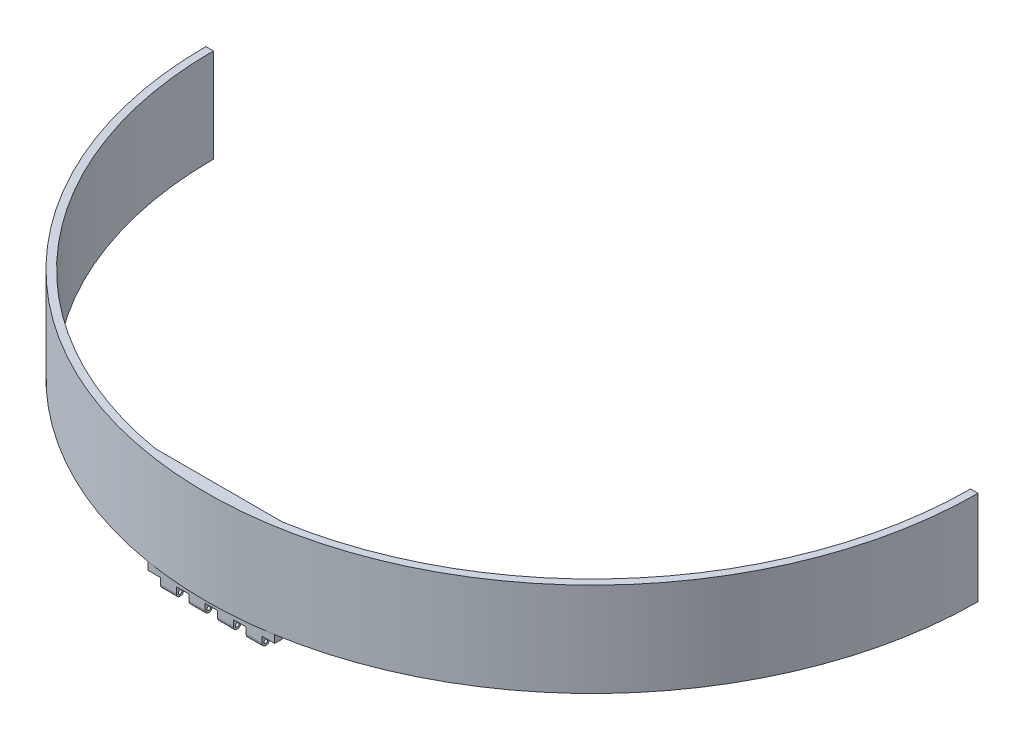
ISO-10303-21;
HEADER;
FILE_DESCRIPTION(('STEP AP214'),'2;1');
FILE_NAME('part.step','',(''),(''),'','','');
FILE_SCHEMA(('AUTOMOTIVE_DESIGN { 1 0 10303 214 1 1 1 1 }'));
ENDSEC;
DATA;
#1=APPLICATION_CONTEXT('core data for automotive mechanical design processes');
#2=APPLICATION_PROTOCOL_DEFINITION('international standard','automotive_design',2000,#1);
#3=PRODUCT_CONTEXT('',#1,'mechanical');
#4=PRODUCT('Part','Part','',(#3));
#5=PRODUCT_RELATED_PRODUCT_CATEGORY('part','',(#4));
#6=PRODUCT_DEFINITION_FORMATION('','',#4);
#7=PRODUCT_DEFINITION_CONTEXT('part definition',#1,'design');
#8=PRODUCT_DEFINITION('design','',#6,#7);
#9=PRODUCT_DEFINITION_SHAPE('','',#8);
#10=(LENGTH_UNIT() NAMED_UNIT(*) SI_UNIT(.MILLI.,.METRE.));
#11=(NAMED_UNIT(*) PLANE_ANGLE_UNIT() SI_UNIT($,.RADIAN.));
#12=(NAMED_UNIT(*) SI_UNIT($,.STERADIAN.) SOLID_ANGLE_UNIT());
#13=UNCERTAINTY_MEASURE_WITH_UNIT(LENGTH_MEASURE(1.E-05),#10,'distance_accuracy_value','');
#14=(GEOMETRIC_REPRESENTATION_CONTEXT(3) GLOBAL_UNCERTAINTY_ASSIGNED_CONTEXT((#13)) GLOBAL_UNIT_ASSIGNED_CONTEXT((#10,
#11,#12)) REPRESENTATION_CONTEXT('',''));
#15=CARTESIAN_POINT('',(0.,0.,0.));
#16=DIRECTION('',(0.,0.,1.));
#17=DIRECTION('',(1.,0.,0.));
#18=AXIS2_PLACEMENT_3D('',#15,#16,#17);
#19=CARTESIAN_POINT('',(-25.,40.,-1.5));
#20=DIRECTION('',(1.,0.,0.));
#21=DIRECTION('',(0.,0.,-1.));
#22=AXIS2_PLACEMENT_3D('',#19,#20,#21);
#23=PLANE('',#22);
#24=DIRECTION('',(0.,0.,1.));
#25=VECTOR('',#24,1.);
#26=CARTESIAN_POINT('',(-25.,3.,-1.5));
#27=LINE('',#26,#25);
#28=CARTESIAN_POINT('',(-25.0000000000001,3.,-1.5));
#29=VERTEX_POINT('',#28);
#30=CARTESIAN_POINT('',(-25.,3.,1.5));
#31=VERTEX_POINT('',#30);
#32=EDGE_CURVE('E286',#29,#31,#27,.T.);
#33=ORIENTED_EDGE('',*,*,#32,.F.);
#34=DIRECTION('',(0.,-1.,0.));
#35=VECTOR('',#34,1.);
#36=CARTESIAN_POINT('',(-25.,40.,-1.5));
#37=LINE('',#36,#35);
#38=CARTESIAN_POINT('',(-25.,0.,-1.5));
#39=VERTEX_POINT('',#38);
#40=EDGE_CURVE('E378',#29,#39,#37,.T.);
#41=ORIENTED_EDGE('',*,*,#40,.T.);
#42=DIRECTION('',(0.,0.,1.));
#43=VECTOR('',#42,1.);
#44=CARTESIAN_POINT('',(-25.,0.,-1.5));
#45=LINE('',#44,#43);
#46=CARTESIAN_POINT('',(-25.,0.,1.5));
#47=VERTEX_POINT('',#46);
#48=EDGE_CURVE('E373',#39,#47,#45,.T.);
#49=ORIENTED_EDGE('',*,*,#48,.T.);
#50=DIRECTION('',(0.,-1.,0.));
#51=VECTOR('',#50,1.);
#52=CARTESIAN_POINT('',(-25.,40.,1.5));
#53=LINE('',#52,#51);
#54=EDGE_CURVE('E410',#31,#47,#53,.T.);
#55=ORIENTED_EDGE('',*,*,#54,.F.);
#56=EDGE_LOOP('',(#33,#41,#49,#55));
#57=FACE_BOUND('',#56,.T.);
#58=ADVANCED_FACE('F39',(#57),#23,.F.);
#59=CARTESIAN_POINT('',(-25.,40.,1.5));
#60=DIRECTION('',(0.,0.,-1.));
#61=DIRECTION('',(-1.,0.,0.));
#62=AXIS2_PLACEMENT_3D('',#59,#60,#61);
#63=PLANE('',#62);
#64=DIRECTION('',(1.,0.,0.));
#65=VECTOR('',#64,1.);
#66=CARTESIAN_POINT('',(-25.,3.,1.5));
#67=LINE('',#66,#65);
#68=CARTESIAN_POINT('',(25.,3.,1.5));
#69=VERTEX_POINT('',#68);
#70=EDGE_CURVE('E55',#31,#69,#67,.T.);
#71=ORIENTED_EDGE('',*,*,#70,.F.);
#72=ORIENTED_EDGE('',*,*,#54,.T.);
#73=DIRECTION('',(1.,0.,0.));
#74=VECTOR('',#73,1.);
#75=CARTESIAN_POINT('',(-25.,0.,1.5));
#76=LINE('',#75,#74);
#77=CARTESIAN_POINT('',(-20.,0.,1.5));
#78=VERTEX_POINT('',#77);
#79=EDGE_CURVE('E384',#47,#78,#76,.T.);
#80=ORIENTED_EDGE('',*,*,#79,.T.);
#81=DIRECTION('',(0.,1.,0.));
#82=VECTOR('',#81,1.);
#83=CARTESIAN_POINT('',(-20.,-4.,1.5));
#84=LINE('',#83,#82);
#85=CARTESIAN_POINT('',(-20.,-2.5,1.5));
#86=VERTEX_POINT('',#85);
#87=EDGE_CURVE('E361',#86,#78,#84,.T.);
#88=ORIENTED_EDGE('',*,*,#87,.F.);
#89=DIRECTION('',(-1.,0.,0.));
#90=VECTOR('',#89,1.);
#91=CARTESIAN_POINT('',(-13.75,-2.5,1.5));
#92=LINE('',#91,#90);
#93=CARTESIAN_POINT('',(-13.75,-2.5,1.5));
#94=VERTEX_POINT('',#93);
#95=EDGE_CURVE('E419',#86,#94,#92,.F.);
#96=ORIENTED_EDGE('',*,*,#95,.T.);
#97=DIRECTION('',(0.,1.,0.));
#98=VECTOR('',#97,1.);
#99=CARTESIAN_POINT('',(-13.75,-4.,1.5));
#100=LINE('',#99,#98);
#101=CARTESIAN_POINT('',(-13.75,0.,1.5));
#102=VERTEX_POINT('',#101);
#103=EDGE_CURVE('E364',#94,#102,#100,.T.);
#104=ORIENTED_EDGE('',*,*,#103,.T.);
#105=CARTESIAN_POINT('',(-8.75000000000001,0.,1.5));
#106=VERTEX_POINT('',#105);
#107=EDGE_CURVE('E389',#102,#106,#76,.T.);
#108=ORIENTED_EDGE('',*,*,#107,.T.);
#109=DIRECTION('',(0.,1.,0.));
#110=VECTOR('',#109,1.);
#111=CARTESIAN_POINT('',(-8.75000000000001,-4.,1.5));
#112=LINE('',#111,#110);
#113=CARTESIAN_POINT('',(-8.75000000000001,-2.5,1.5));
#114=VERTEX_POINT('',#113);
#115=EDGE_CURVE('E340',#114,#106,#112,.T.);
#116=ORIENTED_EDGE('',*,*,#115,.F.);
#117=DIRECTION('',(-1.,0.,0.));
#118=VECTOR('',#117,1.);
#119=CARTESIAN_POINT('',(-2.50000000000001,-2.5,1.5));
#120=LINE('',#119,#118);
#121=CARTESIAN_POINT('',(-2.50000000000001,-2.5,1.5));
#122=VERTEX_POINT('',#121);
#123=EDGE_CURVE('E441',#114,#122,#120,.F.);
#124=ORIENTED_EDGE('',*,*,#123,.T.);
#125=DIRECTION('',(0.,1.,0.));
#126=VECTOR('',#125,1.);
#127=CARTESIAN_POINT('',(-2.50000000000001,-4.,1.5));
#128=LINE('',#127,#126);
#129=CARTESIAN_POINT('',(-2.50000000000001,0.,1.5));
#130=VERTEX_POINT('',#129);
#131=EDGE_CURVE('E343',#122,#130,#128,.T.);
#132=ORIENTED_EDGE('',*,*,#131,.T.);
#133=CARTESIAN_POINT('',(2.49999999999999,0.,1.5));
#134=VERTEX_POINT('',#133);
#135=EDGE_CURVE('E624',#130,#134,#76,.T.);
#136=ORIENTED_EDGE('',*,*,#135,.T.);
#137=DIRECTION('',(0.,1.,0.));
#138=VECTOR('',#137,1.);
#139=CARTESIAN_POINT('',(2.49999999999999,-4.,1.5));
#140=LINE('',#139,#138);
#141=CARTESIAN_POINT('',(2.49999999999999,-2.5,1.5));
#142=VERTEX_POINT('',#141);
#143=EDGE_CURVE('E320',#142,#134,#140,.T.);
#144=ORIENTED_EDGE('',*,*,#143,.F.);
#145=DIRECTION('',(-1.,0.,0.));
#146=VECTOR('',#145,1.);
#147=CARTESIAN_POINT('',(8.74999999999999,-2.5,1.5));
#148=LINE('',#147,#146);
#149=CARTESIAN_POINT('',(8.74999999999999,-2.5,1.5));
#150=VERTEX_POINT('',#149);
#151=EDGE_CURVE('E464',#142,#150,#148,.F.);
#152=ORIENTED_EDGE('',*,*,#151,.T.);
#153=DIRECTION('',(0.,1.,0.));
#154=VECTOR('',#153,1.);
#155=CARTESIAN_POINT('',(8.74999999999999,-4.,1.5));
#156=LINE('',#155,#154);
#157=CARTESIAN_POINT('',(8.74999999999999,0.,1.5));
#158=VERTEX_POINT('',#157);
#159=EDGE_CURVE('E323',#150,#158,#156,.T.);
#160=ORIENTED_EDGE('',*,*,#159,.T.);
#161=CARTESIAN_POINT('',(13.75,0.,1.5));
#162=VERTEX_POINT('',#161);
#163=EDGE_CURVE('E622',#158,#162,#76,.T.);
#164=ORIENTED_EDGE('',*,*,#163,.T.);
#165=DIRECTION('',(0.,1.,0.));
#166=VECTOR('',#165,1.);
#167=CARTESIAN_POINT('',(13.75,-4.,1.5));
#168=LINE('',#167,#166);
#169=CARTESIAN_POINT('',(13.75,-2.5,1.5));
#170=VERTEX_POINT('',#169);
#171=EDGE_CURVE('E300',#170,#162,#168,.T.);
#172=ORIENTED_EDGE('',*,*,#171,.F.);
#173=DIRECTION('',(-1.,0.,0.));
#174=VECTOR('',#173,1.);
#175=CARTESIAN_POINT('',(20.,-2.5,1.5));
#176=LINE('',#175,#174);
#177=CARTESIAN_POINT('',(20.,-2.5,1.5));
#178=VERTEX_POINT('',#177);
#179=EDGE_CURVE('E486',#170,#178,#176,.F.);
#180=ORIENTED_EDGE('',*,*,#179,.T.);
#181=DIRECTION('',(0.,1.,0.));
#182=VECTOR('',#181,1.);
#183=CARTESIAN_POINT('',(20.,-4.,1.5));
#184=LINE('',#183,#182);
#185=CARTESIAN_POINT('',(20.,0.,1.5));
#186=VERTEX_POINT('',#185);
#187=EDGE_CURVE('E303',#178,#186,#184,.T.);
#188=ORIENTED_EDGE('',*,*,#187,.T.);
#189=CARTESIAN_POINT('',(25.,0.,1.5));
#190=VERTEX_POINT('',#189);
#191=EDGE_CURVE('E383',#186,#190,#76,.T.);
#192=ORIENTED_EDGE('',*,*,#191,.T.);
#193=DIRECTION('',(0.,-1.,0.));
#194=VECTOR('',#193,1.);
#195=CARTESIAN_POINT('',(25.,40.,1.5));
#196=LINE('',#195,#194);
#197=EDGE_CURVE('E407',#69,#190,#196,.T.);
#198=ORIENTED_EDGE('',*,*,#197,.F.);
#199=EDGE_LOOP('',(#71,#72,#80,#88,#96,#104,#108,#116,#124,#132,#136,#144,#152,#160,#164,#172,
#180,#188,#192,#198));
#200=FACE_BOUND('',#199,.T.);
#201=ADVANCED_FACE('F555',(#200),#63,.F.);
#202=CARTESIAN_POINT('',(25.,40.,-1.5));
#203=DIRECTION('',(1.,0.,0.));
#204=DIRECTION('',(0.,0.,-1.));
#205=AXIS2_PLACEMENT_3D('',#202,#203,#204);
#206=PLANE('',#205);
#207=DIRECTION('',(0.,-1.,0.));
#208=VECTOR('',#207,1.);
#209=CARTESIAN_POINT('',(25.,40.,-1.5));
#210=LINE('',#209,#208);
#211=CARTESIAN_POINT('',(25.,3.,-1.5));
#212=VERTEX_POINT('',#211);
#213=CARTESIAN_POINT('',(25.,0.,-1.5));
#214=VERTEX_POINT('',#213);
#215=EDGE_CURVE('E402',#212,#214,#210,.T.);
#216=ORIENTED_EDGE('',*,*,#215,.F.);
#217=DIRECTION('',(0.,0.,1.));
#218=VECTOR('',#217,1.);
#219=CARTESIAN_POINT('',(25.,3.,-1.5));
#220=LINE('',#219,#218);
#221=EDGE_CURVE('E63',#212,#69,#220,.T.);
#222=ORIENTED_EDGE('',*,*,#221,.T.);
#223=ORIENTED_EDGE('',*,*,#197,.T.);
#224=DIRECTION('',(0.,0.,1.));
#225=VECTOR('',#224,1.);
#226=CARTESIAN_POINT('',(25.,0.,-1.5));
#227=LINE('',#226,#225);
#228=EDGE_CURVE('E388',#214,#190,#227,.T.);
#229=ORIENTED_EDGE('',*,*,#228,.F.);
#230=EDGE_LOOP('',(#216,#222,#223,#229));
#231=FACE_BOUND('',#230,.T.);
#232=ADVANCED_FACE('F561',(#231),#206,.T.);
#233=CARTESIAN_POINT('',(0.,0.,0.));
#234=DIRECTION('',(0.,1.,0.));
#235=DIRECTION('',(0.,0.,1.));
#236=AXIS2_PLACEMENT_3D('',#233,#234,#235);
#237=PLANE('',#236);
#238=DIRECTION('',(0.,0.,-1.));
#239=VECTOR('',#238,1.);
#240=CARTESIAN_POINT('',(13.75,0.,1.5));
#241=LINE('',#240,#239);
#242=CARTESIAN_POINT('',(13.75,0.,-1.5));
#243=VERTEX_POINT('',#242);
#244=EDGE_CURVE('E291',#162,#243,#241,.T.);
#245=ORIENTED_EDGE('',*,*,#244,.F.);
#246=ORIENTED_EDGE('',*,*,#163,.F.);
#247=DIRECTION('',(0.,0.,1.));
#248=VECTOR('',#247,1.);
#249=CARTESIAN_POINT('',(8.74999999999999,0.,1.5));
#250=LINE('',#249,#248);
#251=CARTESIAN_POINT('',(8.74999999999999,0.,-1.5));
#252=VERTEX_POINT('',#251);
#253=EDGE_CURVE('E316',#252,#158,#250,.T.);
#254=ORIENTED_EDGE('',*,*,#253,.F.);
#255=DIRECTION('',(1.,0.,0.));
#256=VECTOR('',#255,1.);
#257=CARTESIAN_POINT('',(-25.,0.,-1.5));
#258=LINE('',#257,#256);
#259=EDGE_CURVE('E668',#252,#243,#258,.T.);
#260=ORIENTED_EDGE('',*,*,#259,.T.);
#261=EDGE_LOOP('',(#245,#246,#254,#260));
#262=FACE_BOUND('',#261,.T.);
#263=ADVANCED_FACE('F675',(#262),#237,.F.);
#264=DIRECTION('',(0.,0.,1.));
#265=VECTOR('',#264,1.);
#266=CARTESIAN_POINT('',(20.,0.,1.5));
#267=LINE('',#266,#265);
#268=CARTESIAN_POINT('',(20.,0.,-1.5));
#269=VERTEX_POINT('',#268);
#270=EDGE_CURVE('E295',#269,#186,#267,.T.);
#271=ORIENTED_EDGE('',*,*,#270,.F.);
#272=EDGE_CURVE('E393',#269,#214,#258,.T.);
#273=ORIENTED_EDGE('',*,*,#272,.T.);
#274=ORIENTED_EDGE('',*,*,#228,.T.);
#275=ORIENTED_EDGE('',*,*,#191,.F.);
#276=EDGE_LOOP('',(#271,#273,#274,#275));
#277=FACE_BOUND('',#276,.T.);
#278=ADVANCED_FACE('F619',(#277),#237,.F.);
#279=DIRECTION('',(0.,0.,-1.));
#280=VECTOR('',#279,1.);
#281=CARTESIAN_POINT('',(2.49999999999999,0.,1.5));
#282=LINE('',#281,#280);
#283=CARTESIAN_POINT('',(2.49999999999999,0.,-1.5));
#284=VERTEX_POINT('',#283);
#285=EDGE_CURVE('E312',#134,#284,#282,.T.);
#286=ORIENTED_EDGE('',*,*,#285,.F.);
#287=ORIENTED_EDGE('',*,*,#135,.F.);
#288=DIRECTION('',(0.,0.,1.));
#289=VECTOR('',#288,1.);
#290=CARTESIAN_POINT('',(-2.50000000000001,0.,1.5));
#291=LINE('',#290,#289);
#292=CARTESIAN_POINT('',(-2.50000000000001,0.,-1.5));
#293=VERTEX_POINT('',#292);
#294=EDGE_CURVE('E336',#293,#130,#291,.T.);
#295=ORIENTED_EDGE('',*,*,#294,.F.);
#296=EDGE_CURVE('E665',#293,#284,#258,.T.);
#297=ORIENTED_EDGE('',*,*,#296,.T.);
#298=EDGE_LOOP('',(#286,#287,#295,#297));
#299=FACE_BOUND('',#298,.T.);
#300=ADVANCED_FACE('F944',(#299),#237,.F.);
#301=DIRECTION('',(0.,0.,-1.));
#302=VECTOR('',#301,1.);
#303=CARTESIAN_POINT('',(-8.75000000000001,0.,1.5));
#304=LINE('',#303,#302);
#305=CARTESIAN_POINT('',(-8.75000000000001,0.,-1.5));
#306=VERTEX_POINT('',#305);
#307=EDGE_CURVE('E332',#106,#306,#304,.T.);
#308=ORIENTED_EDGE('',*,*,#307,.F.);
#309=ORIENTED_EDGE('',*,*,#107,.F.);
#310=DIRECTION('',(0.,0.,1.));
#311=VECTOR('',#310,1.);
#312=CARTESIAN_POINT('',(-13.75,0.,1.5));
#313=LINE('',#312,#311);
#314=CARTESIAN_POINT('',(-13.75,0.,-1.5));
#315=VERTEX_POINT('',#314);
#316=EDGE_CURVE('E357',#315,#102,#313,.T.);
#317=ORIENTED_EDGE('',*,*,#316,.F.);
#318=EDGE_CURVE('E397',#315,#306,#258,.T.);
#319=ORIENTED_EDGE('',*,*,#318,.T.);
#320=EDGE_LOOP('',(#308,#309,#317,#319));
#321=FACE_BOUND('',#320,.T.);
#322=ADVANCED_FACE('F639',(#321),#237,.F.);
#323=DIRECTION('',(0.,0.,-1.));
#324=VECTOR('',#323,1.);
#325=CARTESIAN_POINT('',(-20.,0.,1.5));
#326=LINE('',#325,#324);
#327=CARTESIAN_POINT('',(-20.,0.,-1.5));
#328=VERTEX_POINT('',#327);
#329=EDGE_CURVE('E353',#78,#328,#326,.T.);
#330=ORIENTED_EDGE('',*,*,#329,.F.);
#331=ORIENTED_EDGE('',*,*,#79,.F.);
#332=ORIENTED_EDGE('',*,*,#48,.F.);
#333=EDGE_CURVE('E379',#39,#328,#258,.T.);
#334=ORIENTED_EDGE('',*,*,#333,.T.);
#335=EDGE_LOOP('',(#330,#331,#332,#334));
#336=FACE_BOUND('',#335,.T.);
#337=ADVANCED_FACE('F659',(#336),#237,.F.);
#338=CARTESIAN_POINT('',(-25.,40.,-1.5));
#339=DIRECTION('',(0.,0.,-1.));
#340=DIRECTION('',(-1.,0.,0.));
#341=AXIS2_PLACEMENT_3D('',#338,#339,#340);
#342=PLANE('',#341);
#343=DIRECTION('',(0.,1.,0.));
#344=VECTOR('',#343,1.);
#345=CARTESIAN_POINT('',(20.,-4.,-1.5));
#346=LINE('',#345,#344);
#347=CARTESIAN_POINT('',(20.,-2.5,-1.5));
#348=VERTEX_POINT('',#347);
#349=EDGE_CURVE('E306',#348,#269,#346,.T.);
#350=ORIENTED_EDGE('',*,*,#349,.F.);
#351=DIRECTION('',(1.,0.,0.));
#352=VECTOR('',#351,1.);
#353=CARTESIAN_POINT('',(-25.,-2.5,-1.5));
#354=LINE('',#353,#352);
#355=CARTESIAN_POINT('',(13.75,-2.5,-1.5));
#356=VERTEX_POINT('',#355);
#357=EDGE_CURVE('E48',#348,#356,#354,.F.);
#358=ORIENTED_EDGE('',*,*,#357,.T.);
#359=DIRECTION('',(0.,1.,0.));
#360=VECTOR('',#359,1.);
#361=CARTESIAN_POINT('',(13.75,-4.,-1.5));
#362=LINE('',#361,#360);
#363=EDGE_CURVE('E309',#356,#243,#362,.T.);
#364=ORIENTED_EDGE('',*,*,#363,.T.);
#365=ORIENTED_EDGE('',*,*,#259,.F.);
#366=DIRECTION('',(0.,1.,0.));
#367=VECTOR('',#366,1.);
#368=CARTESIAN_POINT('',(8.74999999999999,-4.,-1.5));
#369=LINE('',#368,#367);
#370=CARTESIAN_POINT('',(8.74999999999999,-2.5,-1.5));
#371=VERTEX_POINT('',#370);
#372=EDGE_CURVE('E326',#371,#252,#369,.T.);
#373=ORIENTED_EDGE('',*,*,#372,.F.);
#374=DIRECTION('',(1.,0.,0.));
#375=VECTOR('',#374,1.);
#376=CARTESIAN_POINT('',(-25.,-2.5,-1.5));
#377=LINE('',#376,#375);
#378=CARTESIAN_POINT('',(2.49999999999999,-2.5,-1.5));
#379=VERTEX_POINT('',#378);
#380=EDGE_CURVE('E474',#371,#379,#377,.F.);
#381=ORIENTED_EDGE('',*,*,#380,.T.);
#382=DIRECTION('',(0.,1.,0.));
#383=VECTOR('',#382,1.);
#384=CARTESIAN_POINT('',(2.49999999999999,-4.,-1.5));
#385=LINE('',#384,#383);
#386=EDGE_CURVE('E329',#379,#284,#385,.T.);
#387=ORIENTED_EDGE('',*,*,#386,.T.);
#388=ORIENTED_EDGE('',*,*,#296,.F.);
#389=DIRECTION('',(0.,1.,0.));
#390=VECTOR('',#389,1.);
#391=CARTESIAN_POINT('',(-2.50000000000001,-4.,-1.5));
#392=LINE('',#391,#390);
#393=CARTESIAN_POINT('',(-2.50000000000001,-2.5,-1.5));
#394=VERTEX_POINT('',#393);
#395=EDGE_CURVE('E346',#394,#293,#392,.T.);
#396=ORIENTED_EDGE('',*,*,#395,.F.);
#397=DIRECTION('',(1.,0.,0.));
#398=VECTOR('',#397,1.);
#399=CARTESIAN_POINT('',(-25.,-2.5,-1.5));
#400=LINE('',#399,#398);
#401=CARTESIAN_POINT('',(-8.75000000000001,-2.5,-1.5));
#402=VERTEX_POINT('',#401);
#403=EDGE_CURVE('E451',#394,#402,#400,.F.);
#404=ORIENTED_EDGE('',*,*,#403,.T.);
#405=DIRECTION('',(0.,1.,0.));
#406=VECTOR('',#405,1.);
#407=CARTESIAN_POINT('',(-8.75000000000001,-4.,-1.5));
#408=LINE('',#407,#406);
#409=EDGE_CURVE('E349',#402,#306,#408,.T.);
#410=ORIENTED_EDGE('',*,*,#409,.T.);
#411=ORIENTED_EDGE('',*,*,#318,.F.);
#412=DIRECTION('',(0.,1.,0.));
#413=VECTOR('',#412,1.);
#414=CARTESIAN_POINT('',(-13.75,-4.,-1.5));
#415=LINE('',#414,#413);
#416=CARTESIAN_POINT('',(-13.75,-2.5,-1.5));
#417=VERTEX_POINT('',#416);
#418=EDGE_CURVE('E367',#417,#315,#415,.T.);
#419=ORIENTED_EDGE('',*,*,#418,.F.);
#420=DIRECTION('',(1.,0.,0.));
#421=VECTOR('',#420,1.);
#422=CARTESIAN_POINT('',(-25.,-2.5,-1.5));
#423=LINE('',#422,#421);
#424=CARTESIAN_POINT('',(-20.,-2.5,-1.5));
#425=VERTEX_POINT('',#424);
#426=EDGE_CURVE('E429',#417,#425,#423,.F.);
#427=ORIENTED_EDGE('',*,*,#426,.T.);
#428=DIRECTION('',(0.,1.,0.));
#429=VECTOR('',#428,1.);
#430=CARTESIAN_POINT('',(-20.,-4.,-1.5));
#431=LINE('',#430,#429);
#432=EDGE_CURVE('E370',#425,#328,#431,.T.);
#433=ORIENTED_EDGE('',*,*,#432,.T.);
#434=ORIENTED_EDGE('',*,*,#333,.F.);
#435=ORIENTED_EDGE('',*,*,#40,.F.);
#436=CARTESIAN_POINT('',(-25.,40.,-1.5));
#437=VERTEX_POINT('',#436);
#438=EDGE_CURVE('E398',#437,#29,#37,.T.);
#439=ORIENTED_EDGE('',*,*,#438,.F.);
#440=DIRECTION('',(1.,0.,0.));
#441=VECTOR('',#440,1.);
#442=CARTESIAN_POINT('',(-25.,40.,-1.5));
#443=LINE('',#442,#441);
#444=CARTESIAN_POINT('',(25.,40.,-1.5));
#445=VERTEX_POINT('',#444);
#446=EDGE_CURVE('E374',#437,#445,#443,.T.);
#447=ORIENTED_EDGE('',*,*,#446,.T.);
#448=EDGE_CURVE('E403',#445,#212,#210,.T.);
#449=ORIENTED_EDGE('',*,*,#448,.T.);
#450=ORIENTED_EDGE('',*,*,#215,.T.);
#451=ORIENTED_EDGE('',*,*,#272,.F.);
#452=EDGE_LOOP('',(#350,#358,#364,#365,#373,#381,#387,#388,#396,#404,#410,#411,#419,#427,#433,
#434,#435,#439,#447,#449,#450,#451));
#453=FACE_BOUND('',#452,.T.);
#454=ADVANCED_FACE('F647',(#453),#342,.T.);
#455=CARTESIAN_POINT('',(0.,40.,0.));
#456=DIRECTION('',(0.,1.,0.));
#457=DIRECTION('',(0.,0.,1.));
#458=AXIS2_PLACEMENT_3D('',#455,#456,#457);
#459=PLANE('',#458);
#460=DIRECTION('',(1.,0.,0.));
#461=VECTOR('',#460,1.);
#462=CARTESIAN_POINT('',(-149.381926594553,40.,-148.694252085492));
#463=LINE('',#462,#461);
#464=CARTESIAN_POINT('',(-152.340443830437,40.,-148.694252085492));
#465=VERTEX_POINT('',#464);
#466=CARTESIAN_POINT('',(-149.381926594553,40.,-148.694252085492));
#467=VERTEX_POINT('',#466);
#468=EDGE_CURVE('E241',#465,#467,#463,.T.);
#469=ORIENTED_EDGE('',*,*,#468,.F.);
#470=CARTESIAN_POINT('',(0.,40.,-148.7751388924));
#471=DIRECTION('',(0.,-1.,0.));
#472=DIRECTION('',(0.999996207108304,0.,0.00275422747910546));
#473=AXIS2_PLACEMENT_3D('',#470,#471,#472);
#474=CIRCLE('',#473,152.340465304299);
#475=CARTESIAN_POINT('',(152.339887493413,40.,-148.35555859668));
#476=VERTEX_POINT('',#475);
#477=EDGE_CURVE('E245',#476,#465,#474,.T.);
#478=ORIENTED_EDGE('',*,*,#477,.F.);
#479=DIRECTION('',(1.,0.,0.));
#480=VECTOR('',#479,1.);
#481=CARTESIAN_POINT('',(152.339887493413,40.,-148.35555859668));
#482=LINE('',#481,#480);
#483=CARTESIAN_POINT('',(149.381359239201,40.,-148.35555859668));
#484=VERTEX_POINT('',#483);
#485=EDGE_CURVE('E231',#484,#476,#482,.T.);
#486=ORIENTED_EDGE('',*,*,#485,.F.);
#487=CARTESIAN_POINT('',(0.,40.,-148.7751388924));
#488=DIRECTION('',(0.,-1.,0.));
#489=DIRECTION('',(0.999999853401617,0.,-0.00054147644828519));
#490=AXIS2_PLACEMENT_3D('',#487,#488,#489);
#491=CIRCLE('',#490,149.381948493705);
#492=EDGE_CURVE('E279',#484,#445,#491,.T.);
#493=ORIENTED_EDGE('',*,*,#492,.T.);
#494=ORIENTED_EDGE('',*,*,#446,.F.);
#495=EDGE_CURVE('E274',#437,#467,#491,.T.);
#496=ORIENTED_EDGE('',*,*,#495,.T.);
#497=EDGE_LOOP('',(#469,#478,#486,#493,#494,#496));
#498=FACE_BOUND('',#497,.T.);
#499=ADVANCED_FACE('F246',(#498),#459,.T.);
#500=CARTESIAN_POINT('',(-20.,-4.,1.5));
#501=DIRECTION('',(1.,0.,0.));
#502=DIRECTION('',(0.,0.,-1.));
#503=AXIS2_PLACEMENT_3D('',#500,#501,#502);
#504=PLANE('',#503);
#505=CARTESIAN_POINT('',(-20.,-2.5,0.));
#506=DIRECTION('',(-1.,0.,0.));
#507=DIRECTION('',(0.,0.,1.));
#508=AXIS2_PLACEMENT_3D('',#505,#506,#507);
#509=CIRCLE('',#508,0.75);
#510=CARTESIAN_POINT('',(-20.,-2.5,0.75));
#511=VERTEX_POINT('',#510);
#512=EDGE_CURVE('E504',#511,#511,#509,.T.);
#513=ORIENTED_EDGE('',*,*,#512,.F.);
#514=EDGE_LOOP('',(#513));
#515=FACE_BOUND('',#514,.T.);
#516=CARTESIAN_POINT('',(-20.,-2.5,0.));
#517=DIRECTION('',(1.,0.,0.));
#518=DIRECTION('',(0.,0.,-1.));
#519=AXIS2_PLACEMENT_3D('',#516,#517,#518);
#520=CIRCLE('',#519,1.5);
#521=CARTESIAN_POINT('',(-20.,-4.,0.));
#522=VERTEX_POINT('',#521);
#523=EDGE_CURVE('E413',#425,#522,#520,.F.);
#524=ORIENTED_EDGE('',*,*,#523,.T.);
#525=CARTESIAN_POINT('',(-20.,-2.5,0.));
#526=DIRECTION('',(1.,0.,0.));
#527=DIRECTION('',(0.,0.,-1.));
#528=AXIS2_PLACEMENT_3D('',#525,#526,#527);
#529=CIRCLE('',#528,1.5);
#530=EDGE_CURVE('E416',#522,#86,#529,.F.);
#531=ORIENTED_EDGE('',*,*,#530,.T.);
#532=ORIENTED_EDGE('',*,*,#87,.T.);
#533=ORIENTED_EDGE('',*,*,#329,.T.);
#534=ORIENTED_EDGE('',*,*,#432,.F.);
#535=EDGE_LOOP('',(#524,#531,#532,#533,#534));
#536=FACE_BOUND('',#535,.T.);
#537=ADVANCED_FACE('F653',(#515,#536),#504,.F.);
#538=CARTESIAN_POINT('',(-13.75,-4.,1.5));
#539=DIRECTION('',(-1.,0.,0.));
#540=DIRECTION('',(0.,0.,1.));
#541=AXIS2_PLACEMENT_3D('',#538,#539,#540);
#542=PLANE('',#541);
#543=CARTESIAN_POINT('',(-13.75,-2.5,0.));
#544=DIRECTION('',(-1.,0.,0.));
#545=DIRECTION('',(0.,0.,1.));
#546=AXIS2_PLACEMENT_3D('',#543,#544,#545);
#547=CIRCLE('',#546,0.75);
#548=CARTESIAN_POINT('',(-13.75,-2.5,0.75));
#549=VERTEX_POINT('',#548);
#550=EDGE_CURVE('E259',#549,#549,#547,.T.);
#551=ORIENTED_EDGE('',*,*,#550,.T.);
#552=EDGE_LOOP('',(#551));
#553=FACE_BOUND('',#552,.T.);
#554=ORIENTED_EDGE('',*,*,#103,.F.);
#555=CARTESIAN_POINT('',(-13.75,-2.5,0.));
#556=DIRECTION('',(-1.,0.,0.));
#557=DIRECTION('',(0.,0.,1.));
#558=AXIS2_PLACEMENT_3D('',#555,#556,#557);
#559=CIRCLE('',#558,1.5);
#560=CARTESIAN_POINT('',(-13.75,-4.,0.));
#561=VERTEX_POINT('',#560);
#562=EDGE_CURVE('E426',#94,#561,#559,.F.);
#563=ORIENTED_EDGE('',*,*,#562,.T.);
#564=CARTESIAN_POINT('',(-13.75,-2.5,0.));
#565=DIRECTION('',(-1.,0.,0.));
#566=DIRECTION('',(0.,0.,1.));
#567=AXIS2_PLACEMENT_3D('',#564,#565,#566);
#568=CIRCLE('',#567,1.5);
#569=EDGE_CURVE('E423',#561,#417,#568,.F.);
#570=ORIENTED_EDGE('',*,*,#569,.T.);
#571=ORIENTED_EDGE('',*,*,#418,.T.);
#572=ORIENTED_EDGE('',*,*,#316,.T.);
#573=EDGE_LOOP('',(#554,#563,#570,#571,#572));
#574=FACE_BOUND('',#573,.T.);
#575=ADVANCED_FACE('F573',(#553,#574),#542,.F.);
#576=CARTESIAN_POINT('',(0.,-2.5,0.));
#577=DIRECTION('',(1.,0.,0.));
#578=DIRECTION('',(0.,0.,-1.));
#579=AXIS2_PLACEMENT_3D('',#576,#577,#578);
#580=CYLINDRICAL_SURFACE('',#579,1.5);
#581=ORIENTED_EDGE('',*,*,#426,.F.);
#582=ORIENTED_EDGE('',*,*,#569,.F.);
#583=DIRECTION('',(1.,0.,0.));
#584=VECTOR('',#583,1.);
#585=CARTESIAN_POINT('',(0.,-4.,0.));
#586=LINE('',#585,#584);
#587=EDGE_CURVE('E352',#522,#561,#586,.T.);
#588=ORIENTED_EDGE('',*,*,#587,.F.);
#589=ORIENTED_EDGE('',*,*,#523,.F.);
#590=EDGE_LOOP('',(#581,#582,#588,#589));
#591=FACE_BOUND('',#590,.T.);
#592=ADVANCED_FACE('F569',(#591),#580,.T.);
#593=CARTESIAN_POINT('',(0.,-2.5,0.));
#594=DIRECTION('',(1.,0.,0.));
#595=DIRECTION('',(0.,0.,-1.));
#596=AXIS2_PLACEMENT_3D('',#593,#594,#595);
#597=CYLINDRICAL_SURFACE('',#596,1.5);
#598=ORIENTED_EDGE('',*,*,#562,.F.);
#599=ORIENTED_EDGE('',*,*,#95,.F.);
#600=ORIENTED_EDGE('',*,*,#530,.F.);
#601=ORIENTED_EDGE('',*,*,#587,.T.);
#602=EDGE_LOOP('',(#598,#599,#600,#601));
#603=FACE_BOUND('',#602,.T.);
#604=ADVANCED_FACE('F566',(#603),#597,.T.);
#605=CARTESIAN_POINT('',(-8.75000000000001,-4.,1.5));
#606=DIRECTION('',(1.,0.,0.));
#607=DIRECTION('',(0.,0.,-1.));
#608=AXIS2_PLACEMENT_3D('',#605,#606,#607);
#609=PLANE('',#608);
#610=CARTESIAN_POINT('',(-8.75000000000001,-2.5,0.));
#611=DIRECTION('',(1.,0.,0.));
#612=DIRECTION('',(0.,0.,-1.));
#613=AXIS2_PLACEMENT_3D('',#610,#611,#612);
#614=CIRCLE('',#613,0.75);
#615=CARTESIAN_POINT('',(-8.75000000000001,-2.5,-0.75));
#616=VERTEX_POINT('',#615);
#617=EDGE_CURVE('E263',#616,#616,#614,.T.);
#618=ORIENTED_EDGE('',*,*,#617,.T.);
#619=EDGE_LOOP('',(#618));
#620=FACE_BOUND('',#619,.T.);
#621=CARTESIAN_POINT('',(-8.75000000000001,-2.5,0.));
#622=DIRECTION('',(1.,0.,0.));
#623=DIRECTION('',(0.,0.,-1.));
#624=AXIS2_PLACEMENT_3D('',#621,#622,#623);
#625=CIRCLE('',#624,1.5);
#626=CARTESIAN_POINT('',(-8.75000000000001,-4.,0.));
#627=VERTEX_POINT('',#626);
#628=EDGE_CURVE('E432',#402,#627,#625,.F.);
#629=ORIENTED_EDGE('',*,*,#628,.T.);
#630=CARTESIAN_POINT('',(-8.75000000000001,-2.5,0.));
#631=DIRECTION('',(1.,0.,0.));
#632=DIRECTION('',(0.,0.,-1.));
#633=AXIS2_PLACEMENT_3D('',#630,#631,#632);
#634=CIRCLE('',#633,1.5);
#635=EDGE_CURVE('E438',#627,#114,#634,.F.);
#636=ORIENTED_EDGE('',*,*,#635,.T.);
#637=ORIENTED_EDGE('',*,*,#115,.T.);
#638=ORIENTED_EDGE('',*,*,#307,.T.);
#639=ORIENTED_EDGE('',*,*,#409,.F.);
#640=EDGE_LOOP('',(#629,#636,#637,#638,#639));
#641=FACE_BOUND('',#640,.T.);
#642=ADVANCED_FACE('F535',(#620,#641),#609,.F.);
#643=CARTESIAN_POINT('',(-2.50000000000001,-4.,1.5));
#644=DIRECTION('',(-1.,0.,0.));
#645=DIRECTION('',(0.,0.,1.));
#646=AXIS2_PLACEMENT_3D('',#643,#644,#645);
#647=PLANE('',#646);
#648=CARTESIAN_POINT('',(-2.5,-2.5,0.));
#649=DIRECTION('',(-1.,0.,0.));
#650=DIRECTION('',(0.,0.,1.));
#651=AXIS2_PLACEMENT_3D('',#648,#649,#650);
#652=CIRCLE('',#651,0.75);
#653=CARTESIAN_POINT('',(-2.5,-2.5,0.75));
#654=VERTEX_POINT('',#653);
#655=EDGE_CURVE('E528',#654,#654,#652,.T.);
#656=ORIENTED_EDGE('',*,*,#655,.T.);
#657=EDGE_LOOP('',(#656));
#658=FACE_BOUND('',#657,.T.);
#659=ORIENTED_EDGE('',*,*,#131,.F.);
#660=CARTESIAN_POINT('',(-2.50000000000001,-2.5,0.));
#661=DIRECTION('',(-1.,0.,0.));
#662=DIRECTION('',(0.,0.,1.));
#663=AXIS2_PLACEMENT_3D('',#660,#661,#662);
#664=CIRCLE('',#663,1.5);
#665=CARTESIAN_POINT('',(-2.50000000000001,-4.,0.));
#666=VERTEX_POINT('',#665);
#667=EDGE_CURVE('E448',#122,#666,#664,.F.);
#668=ORIENTED_EDGE('',*,*,#667,.T.);
#669=CARTESIAN_POINT('',(-2.50000000000001,-2.5,0.));
#670=DIRECTION('',(-1.,0.,0.));
#671=DIRECTION('',(0.,0.,1.));
#672=AXIS2_PLACEMENT_3D('',#669,#670,#671);
#673=CIRCLE('',#672,1.5);
#674=EDGE_CURVE('E445',#666,#394,#673,.F.);
#675=ORIENTED_EDGE('',*,*,#674,.T.);
#676=ORIENTED_EDGE('',*,*,#395,.T.);
#677=ORIENTED_EDGE('',*,*,#294,.T.);
#678=EDGE_LOOP('',(#659,#668,#675,#676,#677));
#679=FACE_BOUND('',#678,.T.);
#680=ADVANCED_FACE('F832',(#658,#679),#647,.F.);
#681=CARTESIAN_POINT('',(2.49999999999999,-4.,1.5));
#682=DIRECTION('',(1.,0.,0.));
#683=DIRECTION('',(0.,0.,-1.));
#684=AXIS2_PLACEMENT_3D('',#681,#682,#683);
#685=PLANE('',#684);
#686=CARTESIAN_POINT('',(2.5,-2.5,0.));
#687=DIRECTION('',(1.,0.,0.));
#688=DIRECTION('',(0.,0.,-1.));
#689=AXIS2_PLACEMENT_3D('',#686,#687,#688);
#690=CIRCLE('',#689,0.75);
#691=CARTESIAN_POINT('',(2.5,-2.5,-0.75));
#692=VERTEX_POINT('',#691);
#693=EDGE_CURVE('E524',#692,#692,#690,.T.);
#694=ORIENTED_EDGE('',*,*,#693,.T.);
#695=EDGE_LOOP('',(#694));
#696=FACE_BOUND('',#695,.T.);
#697=CARTESIAN_POINT('',(2.49999999999999,-2.5,0.));
#698=DIRECTION('',(1.,0.,0.));
#699=DIRECTION('',(0.,0.,-1.));
#700=AXIS2_PLACEMENT_3D('',#697,#698,#699);
#701=CIRCLE('',#700,1.5);
#702=CARTESIAN_POINT('',(2.49999999999999,-4.,0.));
#703=VERTEX_POINT('',#702);
#704=EDGE_CURVE('E454',#379,#703,#701,.F.);
#705=ORIENTED_EDGE('',*,*,#704,.T.);
#706=CARTESIAN_POINT('',(2.49999999999999,-2.5,0.));
#707=DIRECTION('',(1.,0.,0.));
#708=DIRECTION('',(0.,0.,-1.));
#709=AXIS2_PLACEMENT_3D('',#706,#707,#708);
#710=CIRCLE('',#709,1.5);
#711=EDGE_CURVE('E461',#703,#142,#710,.F.);
#712=ORIENTED_EDGE('',*,*,#711,.T.);
#713=ORIENTED_EDGE('',*,*,#143,.T.);
#714=ORIENTED_EDGE('',*,*,#285,.T.);
#715=ORIENTED_EDGE('',*,*,#386,.F.);
#716=EDGE_LOOP('',(#705,#712,#713,#714,#715));
#717=FACE_BOUND('',#716,.T.);
#718=ADVANCED_FACE('F822',(#696,#717),#685,.F.);
#719=CARTESIAN_POINT('',(8.74999999999999,-4.,1.5));
#720=DIRECTION('',(-1.,0.,0.));
#721=DIRECTION('',(0.,0.,1.));
#722=AXIS2_PLACEMENT_3D('',#719,#720,#721);
#723=PLANE('',#722);
#724=CARTESIAN_POINT('',(8.74999999999998,-2.5,0.));
#725=DIRECTION('',(-1.,0.,0.));
#726=DIRECTION('',(0.,0.,1.));
#727=AXIS2_PLACEMENT_3D('',#724,#725,#726);
#728=CIRCLE('',#727,0.75);
#729=CARTESIAN_POINT('',(8.74999999999998,-2.5,0.75));
#730=VERTEX_POINT('',#729);
#731=EDGE_CURVE('E510',#730,#730,#728,.T.);
#732=ORIENTED_EDGE('',*,*,#731,.T.);
#733=EDGE_LOOP('',(#732));
#734=FACE_BOUND('',#733,.T.);
#735=ORIENTED_EDGE('',*,*,#159,.F.);
#736=CARTESIAN_POINT('',(8.74999999999999,-2.5,0.));
#737=DIRECTION('',(-1.,0.,0.));
#738=DIRECTION('',(0.,0.,1.));
#739=AXIS2_PLACEMENT_3D('',#736,#737,#738);
#740=CIRCLE('',#739,1.5);
#741=CARTESIAN_POINT('',(8.74999999999999,-4.,0.));
#742=VERTEX_POINT('',#741);
#743=EDGE_CURVE('E471',#150,#742,#740,.F.);
#744=ORIENTED_EDGE('',*,*,#743,.T.);
#745=CARTESIAN_POINT('',(8.74999999999999,-2.5,0.));
#746=DIRECTION('',(-1.,0.,0.));
#747=DIRECTION('',(0.,0.,1.));
#748=AXIS2_PLACEMENT_3D('',#745,#746,#747);
#749=CIRCLE('',#748,1.5);
#750=EDGE_CURVE('E468',#742,#371,#749,.F.);
#751=ORIENTED_EDGE('',*,*,#750,.T.);
#752=ORIENTED_EDGE('',*,*,#372,.T.);
#753=ORIENTED_EDGE('',*,*,#253,.T.);
#754=EDGE_LOOP('',(#735,#744,#751,#752,#753));
#755=FACE_BOUND('',#754,.T.);
#756=ADVANCED_FACE('F812',(#734,#755),#723,.F.);
#757=CARTESIAN_POINT('',(13.75,-4.,1.5));
#758=DIRECTION('',(1.,0.,0.));
#759=DIRECTION('',(0.,0.,-1.));
#760=AXIS2_PLACEMENT_3D('',#757,#758,#759);
#761=PLANE('',#760);
#762=CARTESIAN_POINT('',(13.75,-2.5,0.));
#763=DIRECTION('',(1.,0.,0.));
#764=DIRECTION('',(0.,0.,-1.));
#765=AXIS2_PLACEMENT_3D('',#762,#763,#764);
#766=CIRCLE('',#765,0.75);
#767=CARTESIAN_POINT('',(13.75,-2.5,-0.75));
#768=VERTEX_POINT('',#767);
#769=EDGE_CURVE('E503',#768,#768,#766,.T.);
#770=ORIENTED_EDGE('',*,*,#769,.T.);
#771=EDGE_LOOP('',(#770));
#772=FACE_BOUND('',#771,.T.);
#773=CARTESIAN_POINT('',(13.75,-2.5,0.));
#774=DIRECTION('',(1.,0.,0.));
#775=DIRECTION('',(0.,0.,-1.));
#776=AXIS2_PLACEMENT_3D('',#773,#774,#775);
#777=CIRCLE('',#776,1.5);
#778=CARTESIAN_POINT('',(13.75,-4.,0.));
#779=VERTEX_POINT('',#778);
#780=EDGE_CURVE('E477',#356,#779,#777,.F.);
#781=ORIENTED_EDGE('',*,*,#780,.T.);
#782=CARTESIAN_POINT('',(13.75,-2.5,0.));
#783=DIRECTION('',(1.,0.,0.));
#784=DIRECTION('',(0.,0.,-1.));
#785=AXIS2_PLACEMENT_3D('',#782,#783,#784);
#786=CIRCLE('',#785,1.5);
#787=EDGE_CURVE('E483',#779,#170,#786,.F.);
#788=ORIENTED_EDGE('',*,*,#787,.T.);
#789=ORIENTED_EDGE('',*,*,#171,.T.);
#790=ORIENTED_EDGE('',*,*,#244,.T.);
#791=ORIENTED_EDGE('',*,*,#363,.F.);
#792=EDGE_LOOP('',(#781,#788,#789,#790,#791));
#793=FACE_BOUND('',#792,.T.);
#794=ADVANCED_FACE('F679',(#772,#793),#761,.F.);
#795=CARTESIAN_POINT('',(20.,-4.,1.5));
#796=DIRECTION('',(-1.,0.,0.));
#797=DIRECTION('',(0.,0.,1.));
#798=AXIS2_PLACEMENT_3D('',#795,#796,#797);
#799=PLANE('',#798);
#800=CARTESIAN_POINT('',(20.,-2.5,0.));
#801=DIRECTION('',(-1.,0.,0.));
#802=DIRECTION('',(0.,0.,1.));
#803=AXIS2_PLACEMENT_3D('',#800,#801,#802);
#804=CIRCLE('',#803,0.75);
#805=CARTESIAN_POINT('',(20.,-2.5,0.75));
#806=VERTEX_POINT('',#805);
#807=EDGE_CURVE('E500',#806,#806,#804,.T.);
#808=ORIENTED_EDGE('',*,*,#807,.T.);
#809=EDGE_LOOP('',(#808));
#810=FACE_BOUND('',#809,.T.);
#811=ORIENTED_EDGE('',*,*,#187,.F.);
#812=CARTESIAN_POINT('',(20.,-2.5,0.));
#813=DIRECTION('',(-1.,0.,0.));
#814=DIRECTION('',(0.,0.,1.));
#815=AXIS2_PLACEMENT_3D('',#812,#813,#814);
#816=CIRCLE('',#815,1.5);
#817=CARTESIAN_POINT('',(20.,-4.,0.));
#818=VERTEX_POINT('',#817);
#819=EDGE_CURVE('E493',#178,#818,#816,.F.);
#820=ORIENTED_EDGE('',*,*,#819,.T.);
#821=CARTESIAN_POINT('',(20.,-2.5,0.));
#822=DIRECTION('',(-1.,0.,0.));
#823=DIRECTION('',(0.,0.,1.));
#824=AXIS2_PLACEMENT_3D('',#821,#822,#823);
#825=CIRCLE('',#824,1.5);
#826=EDGE_CURVE('E490',#818,#348,#825,.F.);
#827=ORIENTED_EDGE('',*,*,#826,.T.);
#828=ORIENTED_EDGE('',*,*,#349,.T.);
#829=ORIENTED_EDGE('',*,*,#270,.T.);
#830=EDGE_LOOP('',(#811,#820,#827,#828,#829));
#831=FACE_BOUND('',#830,.T.);
#832=ADVANCED_FACE('F583',(#810,#831),#799,.F.);
#833=CARTESIAN_POINT('',(11.25,-2.5,0.));
#834=DIRECTION('',(1.,0.,0.));
#835=DIRECTION('',(0.,0.,-1.));
#836=AXIS2_PLACEMENT_3D('',#833,#834,#835);
#837=CYLINDRICAL_SURFACE('',#836,1.5);
#838=ORIENTED_EDGE('',*,*,#403,.F.);
#839=ORIENTED_EDGE('',*,*,#674,.F.);
#840=DIRECTION('',(1.,0.,0.));
#841=VECTOR('',#840,1.);
#842=CARTESIAN_POINT('',(11.25,-4.,0.));
#843=LINE('',#842,#841);
#844=EDGE_CURVE('E296',#627,#666,#843,.T.);
#845=ORIENTED_EDGE('',*,*,#844,.F.);
#846=ORIENTED_EDGE('',*,*,#628,.F.);
#847=EDGE_LOOP('',(#838,#839,#845,#846));
#848=FACE_BOUND('',#847,.T.);
#849=ADVANCED_FACE('F579',(#848),#837,.T.);
#850=CARTESIAN_POINT('',(11.25,-2.5,0.));
#851=DIRECTION('',(1.,0.,0.));
#852=DIRECTION('',(0.,0.,-1.));
#853=AXIS2_PLACEMENT_3D('',#850,#851,#852);
#854=CYLINDRICAL_SURFACE('',#853,1.5);
#855=ORIENTED_EDGE('',*,*,#667,.F.);
#856=ORIENTED_EDGE('',*,*,#123,.F.);
#857=ORIENTED_EDGE('',*,*,#635,.F.);
#858=ORIENTED_EDGE('',*,*,#844,.T.);
#859=EDGE_LOOP('',(#855,#856,#857,#858));
#860=FACE_BOUND('',#859,.T.);
#861=ADVANCED_FACE('F575',(#860),#854,.T.);
#862=CARTESIAN_POINT('',(22.5,-2.5,0.));
#863=DIRECTION('',(1.,0.,0.));
#864=DIRECTION('',(0.,0.,-1.));
#865=AXIS2_PLACEMENT_3D('',#862,#863,#864);
#866=CYLINDRICAL_SURFACE('',#865,1.5);
#867=ORIENTED_EDGE('',*,*,#380,.F.);
#868=ORIENTED_EDGE('',*,*,#750,.F.);
#869=DIRECTION('',(1.,0.,0.));
#870=VECTOR('',#869,1.);
#871=CARTESIAN_POINT('',(22.5,-4.,0.));
#872=LINE('',#871,#870);
#873=EDGE_CURVE('E458',#703,#742,#872,.T.);
#874=ORIENTED_EDGE('',*,*,#873,.F.);
#875=ORIENTED_EDGE('',*,*,#704,.F.);
#876=EDGE_LOOP('',(#867,#868,#874,#875));
#877=FACE_BOUND('',#876,.T.);
#878=ADVANCED_FACE('F578',(#877),#866,.T.);
#879=CARTESIAN_POINT('',(22.5,-2.5,0.));
#880=DIRECTION('',(1.,0.,0.));
#881=DIRECTION('',(0.,0.,-1.));
#882=AXIS2_PLACEMENT_3D('',#879,#880,#881);
#883=CYLINDRICAL_SURFACE('',#882,1.5);
#884=ORIENTED_EDGE('',*,*,#743,.F.);
#885=ORIENTED_EDGE('',*,*,#151,.F.);
#886=ORIENTED_EDGE('',*,*,#711,.F.);
#887=ORIENTED_EDGE('',*,*,#873,.T.);
#888=EDGE_LOOP('',(#884,#885,#886,#887));
#889=FACE_BOUND('',#888,.T.);
#890=ADVANCED_FACE('F585',(#889),#883,.T.);
#891=CARTESIAN_POINT('',(33.75,-2.5,0.));
#892=DIRECTION('',(1.,0.,0.));
#893=DIRECTION('',(0.,0.,-1.));
#894=AXIS2_PLACEMENT_3D('',#891,#892,#893);
#895=CYLINDRICAL_SURFACE('',#894,1.5);
#896=ORIENTED_EDGE('',*,*,#357,.F.);
#897=ORIENTED_EDGE('',*,*,#826,.F.);
#898=DIRECTION('',(1.,0.,0.));
#899=VECTOR('',#898,1.);
#900=CARTESIAN_POINT('',(33.75,-4.,0.));
#901=LINE('',#900,#899);
#902=EDGE_CURVE('E290',#779,#818,#901,.T.);
#903=ORIENTED_EDGE('',*,*,#902,.F.);
#904=ORIENTED_EDGE('',*,*,#780,.F.);
#905=EDGE_LOOP('',(#896,#897,#903,#904));
#906=FACE_BOUND('',#905,.T.);
#907=ADVANCED_FACE('F41',(#906),#895,.T.);
#908=CARTESIAN_POINT('',(33.75,-2.5,0.));
#909=DIRECTION('',(1.,0.,0.));
#910=DIRECTION('',(0.,0.,-1.));
#911=AXIS2_PLACEMENT_3D('',#908,#909,#910);
#912=CYLINDRICAL_SURFACE('',#911,1.5);
#913=ORIENTED_EDGE('',*,*,#819,.F.);
#914=ORIENTED_EDGE('',*,*,#179,.F.);
#915=ORIENTED_EDGE('',*,*,#787,.F.);
#916=ORIENTED_EDGE('',*,*,#902,.T.);
#917=EDGE_LOOP('',(#913,#914,#915,#916));
#918=FACE_BOUND('',#917,.T.);
#919=ADVANCED_FACE('F591',(#918),#912,.T.);
#920=CARTESIAN_POINT('',(152.339887493413,3.,-148.35555859668));
#921=DIRECTION('',(0.,1.,0.));
#922=DIRECTION('',(0.,0.,1.));
#923=AXIS2_PLACEMENT_3D('',#920,#921,#922);
#924=PLANE('',#923);
#925=CARTESIAN_POINT('',(0.,3.,-148.7751388924));
#926=DIRECTION('',(0.,-1.,0.));
#927=DIRECTION('',(0.999996207108304,0.,0.00275422747910546));
#928=AXIS2_PLACEMENT_3D('',#925,#926,#927);
#929=CIRCLE('',#928,152.340465304299);
#930=CARTESIAN_POINT('',(-152.340443830437,3.,-148.694252085492));
#931=VERTEX_POINT('',#930);
#932=EDGE_CURVE('E251',#31,#931,#929,.T.);
#933=ORIENTED_EDGE('',*,*,#932,.T.);
#934=DIRECTION('',(1.,0.,0.));
#935=VECTOR('',#934,1.);
#936=CARTESIAN_POINT('',(152.339887493413,3.,-148.694252085492));
#937=LINE('',#936,#935);
#938=CARTESIAN_POINT('',(-149.381926594553,3.,-148.694252085492));
#939=VERTEX_POINT('',#938);
#940=EDGE_CURVE('E517',#931,#939,#937,.T.);
#941=ORIENTED_EDGE('',*,*,#940,.T.);
#942=CARTESIAN_POINT('',(0.,3.,-148.7751388924));
#943=DIRECTION('',(0.,-1.,0.));
#944=DIRECTION('',(0.999999853401617,0.,-0.00054147644828519));
#945=AXIS2_PLACEMENT_3D('',#942,#943,#944);
#946=CIRCLE('',#945,149.381948493705);
#947=EDGE_CURVE('E268',#29,#939,#946,.T.);
#948=ORIENTED_EDGE('',*,*,#947,.F.);
#949=ORIENTED_EDGE('',*,*,#32,.T.);
#950=EDGE_LOOP('',(#933,#941,#948,#949));
#951=FACE_BOUND('',#950,.T.);
#952=ADVANCED_FACE('F593',(#951),#924,.F.);
#953=EDGE_CURVE('E269',#69,#31,#929,.T.);
#954=ORIENTED_EDGE('',*,*,#953,.T.);
#955=ORIENTED_EDGE('',*,*,#70,.T.);
#956=EDGE_LOOP('',(#954,#955));
#957=FACE_BOUND('',#956,.T.);
#958=ADVANCED_FACE('F599',(#957),#924,.F.);
#959=CARTESIAN_POINT('',(0.,38.5,-148.7751388924));
#960=DIRECTION('',(0.,-1.,0.));
#961=DIRECTION('',(0.,0.,-1.));
#962=AXIS2_PLACEMENT_3D('',#959,#960,#961);
#963=CYLINDRICAL_SURFACE('',#962,152.340465304299);
#964=ORIENTED_EDGE('',*,*,#477,.T.);
#965=DIRECTION('',(0.,-1.,0.));
#966=VECTOR('',#965,1.);
#967=CARTESIAN_POINT('',(-152.340443830437,38.5,-148.694252085492));
#968=LINE('',#967,#966);
#969=EDGE_CURVE('E703',#465,#931,#968,.T.);
#970=ORIENTED_EDGE('',*,*,#969,.T.);
#971=ORIENTED_EDGE('',*,*,#932,.F.);
#972=ORIENTED_EDGE('',*,*,#953,.F.);
#973=CARTESIAN_POINT('',(152.339887493413,3.,-148.35555859668));
#974=VERTEX_POINT('',#973);
#975=EDGE_CURVE('E257',#974,#69,#929,.T.);
#976=ORIENTED_EDGE('',*,*,#975,.F.);
#977=DIRECTION('',(0.,-1.,0.));
#978=VECTOR('',#977,1.);
#979=CARTESIAN_POINT('',(152.339887493413,40.,-148.35555859668));
#980=LINE('',#979,#978);
#981=EDGE_CURVE('E235',#476,#974,#980,.T.);
#982=ORIENTED_EDGE('',*,*,#981,.F.);
#983=EDGE_LOOP('',(#964,#970,#971,#972,#976,#982));
#984=FACE_BOUND('',#983,.T.);
#985=ADVANCED_FACE('F254',(#984),#963,.T.);
#986=CARTESIAN_POINT('',(0.,38.5,-148.7751388924));
#987=DIRECTION('',(0.,-1.,0.));
#988=DIRECTION('',(0.,0.,-1.));
#989=AXIS2_PLACEMENT_3D('',#986,#987,#988);
#990=CYLINDRICAL_SURFACE('',#989,149.381948493705);
#991=ORIENTED_EDGE('',*,*,#492,.F.);
#992=DIRECTION('',(0.,-1.,0.));
#993=VECTOR('',#992,1.);
#994=CARTESIAN_POINT('',(149.381359239201,38.5,-148.35555859668));
#995=LINE('',#994,#993);
#996=CARTESIAN_POINT('',(149.381359239201,3.,-148.35555859668));
#997=VERTEX_POINT('',#996);
#998=EDGE_CURVE('E237',#484,#997,#995,.T.);
#999=ORIENTED_EDGE('',*,*,#998,.T.);
#1000=EDGE_CURVE('E271',#997,#212,#946,.T.);
#1001=ORIENTED_EDGE('',*,*,#1000,.T.);
#1002=ORIENTED_EDGE('',*,*,#448,.F.);
#1003=EDGE_LOOP('',(#991,#999,#1001,#1002));
#1004=FACE_BOUND('',#1003,.T.);
#1005=ADVANCED_FACE('F691',(#1004),#990,.F.);
#1006=ORIENTED_EDGE('',*,*,#1000,.F.);
#1007=DIRECTION('',(1.,0.,0.));
#1008=VECTOR('',#1007,1.);
#1009=CARTESIAN_POINT('',(152.339887493413,3.,-148.35555859668));
#1010=LINE('',#1009,#1008);
#1011=EDGE_CURVE('E11',#997,#974,#1010,.T.);
#1012=ORIENTED_EDGE('',*,*,#1011,.T.);
#1013=ORIENTED_EDGE('',*,*,#975,.T.);
#1014=ORIENTED_EDGE('',*,*,#221,.F.);
#1015=EDGE_LOOP('',(#1006,#1012,#1013,#1014));
#1016=FACE_BOUND('',#1015,.T.);
#1017=ADVANCED_FACE('F602',(#1016),#924,.F.);
#1018=ORIENTED_EDGE('',*,*,#438,.T.);
#1019=ORIENTED_EDGE('',*,*,#947,.T.);
#1020=DIRECTION('',(0.,1.,0.));
#1021=VECTOR('',#1020,1.);
#1022=CARTESIAN_POINT('',(-149.381926594553,40.,-148.694252085492));
#1023=LINE('',#1022,#1021);
#1024=EDGE_CURVE('E275',#939,#467,#1023,.T.);
#1025=ORIENTED_EDGE('',*,*,#1024,.T.);
#1026=ORIENTED_EDGE('',*,*,#495,.F.);
#1027=EDGE_LOOP('',(#1018,#1019,#1025,#1026));
#1028=FACE_BOUND('',#1027,.T.);
#1029=ADVANCED_FACE('F697',(#1028),#990,.F.);
#1030=CARTESIAN_POINT('',(152.339887493413,-2.5,0.));
#1031=DIRECTION('',(-1.,0.,0.));
#1032=DIRECTION('',(0.,0.,1.));
#1033=AXIS2_PLACEMENT_3D('',#1030,#1031,#1032);
#1034=CYLINDRICAL_SURFACE('',#1033,0.75);
#1035=ORIENTED_EDGE('',*,*,#807,.F.);
#1036=EDGE_LOOP('',(#1035));
#1037=FACE_BOUND('',#1036,.T.);
#1038=ORIENTED_EDGE('',*,*,#769,.F.);
#1039=EDGE_LOOP('',(#1038));
#1040=FACE_BOUND('',#1039,.T.);
#1041=ADVANCED_FACE('F549',(#1037,#1040),#1034,.F.);
#1042=ORIENTED_EDGE('',*,*,#731,.F.);
#1043=EDGE_LOOP('',(#1042));
#1044=FACE_BOUND('',#1043,.T.);
#1045=ORIENTED_EDGE('',*,*,#693,.F.);
#1046=EDGE_LOOP('',(#1045));
#1047=FACE_BOUND('',#1046,.T.);
#1048=ADVANCED_FACE('F541',(#1044,#1047),#1034,.F.);
#1049=ORIENTED_EDGE('',*,*,#655,.F.);
#1050=EDGE_LOOP('',(#1049));
#1051=FACE_BOUND('',#1050,.T.);
#1052=ORIENTED_EDGE('',*,*,#617,.F.);
#1053=EDGE_LOOP('',(#1052));
#1054=FACE_BOUND('',#1053,.T.);
#1055=ADVANCED_FACE('F538',(#1051,#1054),#1034,.F.);
#1056=ORIENTED_EDGE('',*,*,#512,.T.);
#1057=EDGE_LOOP('',(#1056));
#1058=FACE_BOUND('',#1057,.T.);
#1059=ORIENTED_EDGE('',*,*,#550,.F.);
#1060=EDGE_LOOP('',(#1059));
#1061=FACE_BOUND('',#1060,.T.);
#1062=ADVANCED_FACE('F540',(#1058,#1061),#1034,.F.);
#1063=CARTESIAN_POINT('',(-149.381926594553,-4.,-148.694252085492));
#1064=DIRECTION('',(0.,0.,1.));
#1065=DIRECTION('',(1.,0.,0.));
#1066=AXIS2_PLACEMENT_3D('',#1063,#1064,#1065);
#1067=PLANE('',#1066);
#1068=ORIENTED_EDGE('',*,*,#969,.F.);
#1069=ORIENTED_EDGE('',*,*,#468,.T.);
#1070=ORIENTED_EDGE('',*,*,#1024,.F.);
#1071=ORIENTED_EDGE('',*,*,#940,.F.);
#1072=EDGE_LOOP('',(#1068,#1069,#1070,#1071));
#1073=FACE_BOUND('',#1072,.T.);
#1074=ADVANCED_FACE('F548',(#1073),#1067,.F.);
#1075=CARTESIAN_POINT('',(152.339887493413,-4.,-148.35555859668));
#1076=DIRECTION('',(0.,0.,1.));
#1077=DIRECTION('',(1.,0.,0.));
#1078=AXIS2_PLACEMENT_3D('',#1075,#1076,#1077);
#1079=PLANE('',#1078);
#1080=ORIENTED_EDGE('',*,*,#485,.T.);
#1081=ORIENTED_EDGE('',*,*,#981,.T.);
#1082=ORIENTED_EDGE('',*,*,#1011,.F.);
#1083=ORIENTED_EDGE('',*,*,#998,.F.);
#1084=EDGE_LOOP('',(#1080,#1081,#1082,#1083));
#1085=FACE_BOUND('',#1084,.T.);
#1086=ADVANCED_FACE('F233',(#1085),#1079,.F.);
#1087=CLOSED_SHELL('',(#58,#201,#232,#263,#278,#300,#322,#337,#454,#499,#537,#575,#592,#604,
#642,#680,#718,#756,#794,#832,#849,#861,#878,#890,#907,#919,#952,#958,#985,#1005,#1017,#1029,
#1041,#1048,#1055,#1062,#1074,#1086));
#1088=MANIFOLD_SOLID_BREP('B2',#1087);
#1089=ADVANCED_BREP_SHAPE_REPRESENTATION('',(#18,#1088),#14);
#1090=SHAPE_DEFINITION_REPRESENTATION(#9,#1089);
ENDSEC;
END-ISO-10303-21;
